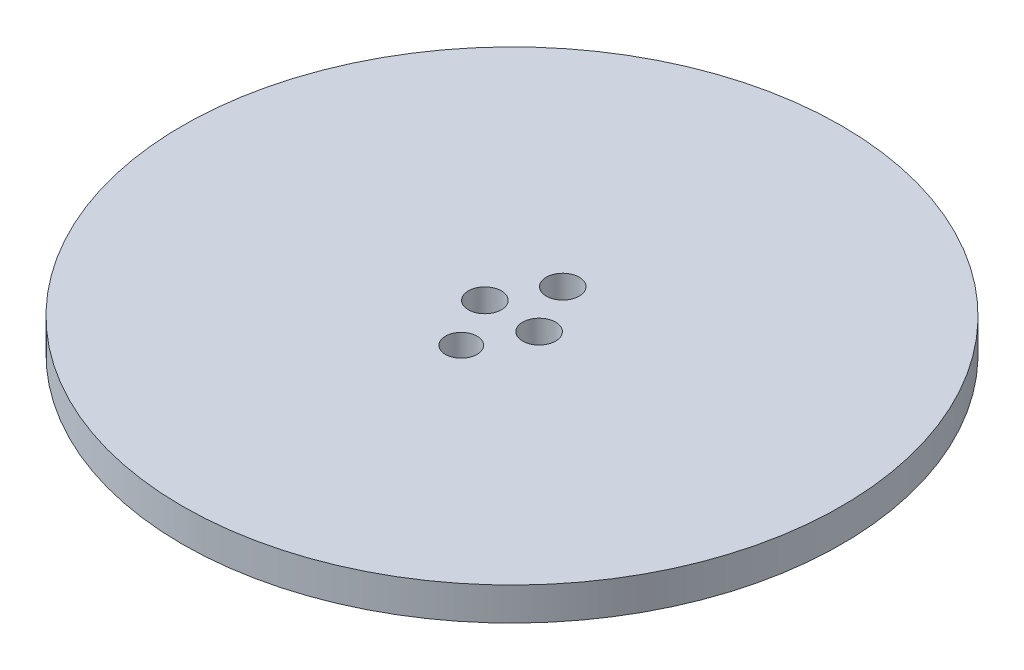
ISO-10303-21;
HEADER;
FILE_DESCRIPTION(('STEP AP214'),'2;1');
FILE_NAME('part.step','',(''),(''),'','','');
FILE_SCHEMA(('AUTOMOTIVE_DESIGN { 1 0 10303 214 1 1 1 1 }'));
ENDSEC;
DATA;
#1=APPLICATION_CONTEXT('core data for automotive mechanical design processes');
#2=APPLICATION_PROTOCOL_DEFINITION('international standard','automotive_design',2000,#1);
#3=PRODUCT_CONTEXT('',#1,'mechanical');
#4=PRODUCT('Part','Part','',(#3));
#5=PRODUCT_RELATED_PRODUCT_CATEGORY('part','',(#4));
#6=PRODUCT_DEFINITION_FORMATION('','',#4);
#7=PRODUCT_DEFINITION_CONTEXT('part definition',#1,'design');
#8=PRODUCT_DEFINITION('design','',#6,#7);
#9=PRODUCT_DEFINITION_SHAPE('','',#8);
#10=(LENGTH_UNIT() NAMED_UNIT(*) SI_UNIT(.MILLI.,.METRE.));
#11=(NAMED_UNIT(*) PLANE_ANGLE_UNIT() SI_UNIT($,.RADIAN.));
#12=(NAMED_UNIT(*) SI_UNIT($,.STERADIAN.) SOLID_ANGLE_UNIT());
#13=UNCERTAINTY_MEASURE_WITH_UNIT(LENGTH_MEASURE(1.E-05),#10,'distance_accuracy_value','');
#14=(GEOMETRIC_REPRESENTATION_CONTEXT(3) GLOBAL_UNCERTAINTY_ASSIGNED_CONTEXT((#13)) GLOBAL_UNIT_ASSIGNED_CONTEXT((#10,
#11,#12)) REPRESENTATION_CONTEXT('',''));
#15=CARTESIAN_POINT('',(0.,0.,0.));
#16=DIRECTION('',(0.,0.,1.));
#17=DIRECTION('',(1.,0.,0.));
#18=AXIS2_PLACEMENT_3D('',#15,#16,#17);
#19=CARTESIAN_POINT('',(0.,6.35,0.));
#20=DIRECTION('',(0.,-1.,0.));
#21=DIRECTION('',(0.,0.,-1.));
#22=AXIS2_PLACEMENT_3D('',#19,#20,#21);
#23=CYLINDRICAL_SURFACE('',#22,15.875);
#24=CARTESIAN_POINT('',(0.,6.35,0.));
#25=DIRECTION('',(0.,1.,0.));
#26=DIRECTION('',(0.,0.,1.));
#27=AXIS2_PLACEMENT_3D('',#24,#25,#26);
#28=CIRCLE('',#27,15.875);
#29=CARTESIAN_POINT('',(0.,6.35,15.875));
#30=VERTEX_POINT('',#29);
#31=EDGE_CURVE('E10',#30,#30,#28,.T.);
#32=ORIENTED_EDGE('',*,*,#31,.F.);
#33=EDGE_LOOP('',(#32));
#34=FACE_BOUND('',#33,.T.);
#35=CARTESIAN_POINT('',(0.,0.,0.));
#36=DIRECTION('',(0.,1.,0.));
#37=DIRECTION('',(0.,0.,1.));
#38=AXIS2_PLACEMENT_3D('',#35,#36,#37);
#39=CIRCLE('',#38,15.875);
#40=CARTESIAN_POINT('',(0.,0.,15.875));
#41=VERTEX_POINT('',#40);
#42=EDGE_CURVE('E34',#41,#41,#39,.T.);
#43=ORIENTED_EDGE('',*,*,#42,.T.);
#44=EDGE_LOOP('',(#43));
#45=FACE_BOUND('',#44,.T.);
#46=ADVANCED_FACE('F31',(#34,#45),#23,.T.);
#47=CARTESIAN_POINT('',(0.,0.,0.));
#48=DIRECTION('',(0.,1.,0.));
#49=DIRECTION('',(0.,0.,1.));
#50=AXIS2_PLACEMENT_3D('',#47,#48,#49);
#51=PLANE('',#50);
#52=CARTESIAN_POINT('',(5.22478,0.,0.));
#53=DIRECTION('',(0.,-1.,0.));
#54=DIRECTION('',(0.,0.,-1.));
#55=AXIS2_PLACEMENT_3D('',#52,#53,#54);
#56=CIRCLE('',#55,3.175);
#57=CARTESIAN_POINT('',(5.22478,0.,-3.175));
#58=VERTEX_POINT('',#57);
#59=EDGE_CURVE('E67',#58,#58,#56,.T.);
#60=ORIENTED_EDGE('',*,*,#59,.F.);
#61=EDGE_LOOP('',(#60));
#62=FACE_BOUND('',#61,.T.);
#63=CARTESIAN_POINT('',(-5.22478,0.,0.));
#64=DIRECTION('',(0.,-1.,0.));
#65=DIRECTION('',(0.,0.,-1.));
#66=AXIS2_PLACEMENT_3D('',#63,#64,#65);
#67=CIRCLE('',#66,3.175);
#68=CARTESIAN_POINT('',(-5.22478,0.,-3.175));
#69=VERTEX_POINT('',#68);
#70=EDGE_CURVE('E61',#69,#69,#67,.T.);
#71=ORIENTED_EDGE('',*,*,#70,.F.);
#72=EDGE_LOOP('',(#71));
#73=FACE_BOUND('',#72,.T.);
#74=CARTESIAN_POINT('',(0.,0.,-9.779));
#75=DIRECTION('',(0.,-1.,0.));
#76=DIRECTION('',(0.,0.,-1.));
#77=AXIS2_PLACEMENT_3D('',#74,#75,#76);
#78=CIRCLE('',#77,3.175);
#79=CARTESIAN_POINT('',(0.,0.,-12.954));
#80=VERTEX_POINT('',#79);
#81=EDGE_CURVE('E55',#80,#80,#78,.T.);
#82=ORIENTED_EDGE('',*,*,#81,.F.);
#83=EDGE_LOOP('',(#82));
#84=FACE_BOUND('',#83,.T.);
#85=CARTESIAN_POINT('',(0.,0.,9.779));
#86=DIRECTION('',(0.,-1.,0.));
#87=DIRECTION('',(0.,0.,-1.));
#88=AXIS2_PLACEMENT_3D('',#85,#86,#87);
#89=CIRCLE('',#88,3.048);
#90=CARTESIAN_POINT('',(0.,0.,6.731));
#91=VERTEX_POINT('',#90);
#92=EDGE_CURVE('E49',#91,#91,#89,.T.);
#93=ORIENTED_EDGE('',*,*,#92,.F.);
#94=EDGE_LOOP('',(#93));
#95=FACE_BOUND('',#94,.T.);
#96=ORIENTED_EDGE('',*,*,#42,.F.);
#97=EDGE_LOOP('',(#96));
#98=FACE_BOUND('',#97,.T.);
#99=ADVANCED_FACE('F83',(#62,#73,#84,#95,#98),#51,.F.);
#100=CARTESIAN_POINT('',(0.,12.7,0.));
#101=DIRECTION('',(0.,-1.,0.));
#102=DIRECTION('',(0.,0.,-1.));
#103=AXIS2_PLACEMENT_3D('',#100,#101,#102);
#104=CYLINDRICAL_SURFACE('',#103,63.5);
#105=CARTESIAN_POINT('',(0.,12.7,0.));
#106=DIRECTION('',(0.,1.,0.));
#107=DIRECTION('',(0.,0.,1.));
#108=AXIS2_PLACEMENT_3D('',#105,#106,#107);
#109=CIRCLE('',#108,63.5);
#110=CARTESIAN_POINT('',(0.,12.7,63.5));
#111=VERTEX_POINT('',#110);
#112=EDGE_CURVE('E41',#111,#111,#109,.T.);
#113=ORIENTED_EDGE('',*,*,#112,.F.);
#114=EDGE_LOOP('',(#113));
#115=FACE_BOUND('',#114,.T.);
#116=CARTESIAN_POINT('',(0.,6.35,0.));
#117=DIRECTION('',(0.,1.,0.));
#118=DIRECTION('',(0.,0.,1.));
#119=AXIS2_PLACEMENT_3D('',#116,#117,#118);
#120=CIRCLE('',#119,63.5);
#121=CARTESIAN_POINT('',(0.,6.35,63.5));
#122=VERTEX_POINT('',#121);
#123=EDGE_CURVE('E43',#122,#122,#120,.T.);
#124=ORIENTED_EDGE('',*,*,#123,.T.);
#125=EDGE_LOOP('',(#124));
#126=FACE_BOUND('',#125,.T.);
#127=ADVANCED_FACE('F86',(#115,#126),#104,.T.);
#128=CARTESIAN_POINT('',(0.,12.7,0.));
#129=DIRECTION('',(0.,1.,0.));
#130=DIRECTION('',(0.,0.,1.));
#131=AXIS2_PLACEMENT_3D('',#128,#129,#130);
#132=PLANE('',#131);
#133=CARTESIAN_POINT('',(5.22478,12.7,0.));
#134=DIRECTION('',(0.,-1.,0.));
#135=DIRECTION('',(0.,0.,-1.));
#136=AXIS2_PLACEMENT_3D('',#133,#134,#135);
#137=CIRCLE('',#136,3.175);
#138=CARTESIAN_POINT('',(5.22478,12.7,-3.175));
#139=VERTEX_POINT('',#138);
#140=EDGE_CURVE('E64',#139,#139,#137,.T.);
#141=ORIENTED_EDGE('',*,*,#140,.T.);
#142=EDGE_LOOP('',(#141));
#143=FACE_BOUND('',#142,.T.);
#144=CARTESIAN_POINT('',(-5.22478,12.7,0.));
#145=DIRECTION('',(0.,-1.,0.));
#146=DIRECTION('',(0.,0.,-1.));
#147=AXIS2_PLACEMENT_3D('',#144,#145,#146);
#148=CIRCLE('',#147,3.175);
#149=CARTESIAN_POINT('',(-5.22478,12.7,-3.175));
#150=VERTEX_POINT('',#149);
#151=EDGE_CURVE('E58',#150,#150,#148,.T.);
#152=ORIENTED_EDGE('',*,*,#151,.T.);
#153=EDGE_LOOP('',(#152));
#154=FACE_BOUND('',#153,.T.);
#155=CARTESIAN_POINT('',(0.,12.7,-9.779));
#156=DIRECTION('',(0.,-1.,0.));
#157=DIRECTION('',(0.,0.,-1.));
#158=AXIS2_PLACEMENT_3D('',#155,#156,#157);
#159=CIRCLE('',#158,3.175);
#160=CARTESIAN_POINT('',(0.,12.7,-12.954));
#161=VERTEX_POINT('',#160);
#162=EDGE_CURVE('E52',#161,#161,#159,.T.);
#163=ORIENTED_EDGE('',*,*,#162,.T.);
#164=EDGE_LOOP('',(#163));
#165=FACE_BOUND('',#164,.T.);
#166=CARTESIAN_POINT('',(0.,12.7,9.779));
#167=DIRECTION('',(0.,-1.,0.));
#168=DIRECTION('',(0.,0.,-1.));
#169=AXIS2_PLACEMENT_3D('',#166,#167,#168);
#170=CIRCLE('',#169,3.048);
#171=CARTESIAN_POINT('',(0.,12.7,6.731));
#172=VERTEX_POINT('',#171);
#173=EDGE_CURVE('E46',#172,#172,#170,.T.);
#174=ORIENTED_EDGE('',*,*,#173,.T.);
#175=EDGE_LOOP('',(#174));
#176=FACE_BOUND('',#175,.T.);
#177=ORIENTED_EDGE('',*,*,#112,.T.);
#178=EDGE_LOOP('',(#177));
#179=FACE_BOUND('',#178,.T.);
#180=ADVANCED_FACE('F73',(#143,#154,#165,#176,#179),#132,.T.);
#181=CARTESIAN_POINT('',(0.,6.35,0.));
#182=DIRECTION('',(0.,1.,0.));
#183=DIRECTION('',(0.,0.,1.));
#184=AXIS2_PLACEMENT_3D('',#181,#182,#183);
#185=PLANE('',#184);
#186=ORIENTED_EDGE('',*,*,#31,.T.);
#187=EDGE_LOOP('',(#186));
#188=FACE_BOUND('',#187,.T.);
#189=ORIENTED_EDGE('',*,*,#123,.F.);
#190=EDGE_LOOP('',(#189));
#191=FACE_BOUND('',#190,.T.);
#192=ADVANCED_FACE('F118',(#188,#191),#185,.F.);
#193=CARTESIAN_POINT('',(0.,12.7,9.779));
#194=DIRECTION('',(0.,-1.,0.));
#195=DIRECTION('',(0.,0.,-1.));
#196=AXIS2_PLACEMENT_3D('',#193,#194,#195);
#197=CYLINDRICAL_SURFACE('',#196,3.048);
#198=ORIENTED_EDGE('',*,*,#173,.F.);
#199=EDGE_LOOP('',(#198));
#200=FACE_BOUND('',#199,.T.);
#201=ORIENTED_EDGE('',*,*,#92,.T.);
#202=EDGE_LOOP('',(#201));
#203=FACE_BOUND('',#202,.T.);
#204=ADVANCED_FACE('F125',(#200,#203),#197,.F.);
#205=CARTESIAN_POINT('',(0.,12.7,-9.779));
#206=DIRECTION('',(0.,-1.,0.));
#207=DIRECTION('',(0.,0.,-1.));
#208=AXIS2_PLACEMENT_3D('',#205,#206,#207);
#209=CYLINDRICAL_SURFACE('',#208,3.175);
#210=ORIENTED_EDGE('',*,*,#162,.F.);
#211=EDGE_LOOP('',(#210));
#212=FACE_BOUND('',#211,.T.);
#213=ORIENTED_EDGE('',*,*,#81,.T.);
#214=EDGE_LOOP('',(#213));
#215=FACE_BOUND('',#214,.T.);
#216=ADVANCED_FACE('F132',(#212,#215),#209,.F.);
#217=CARTESIAN_POINT('',(-5.22478,12.7,0.));
#218=DIRECTION('',(0.,-1.,0.));
#219=DIRECTION('',(0.,0.,-1.));
#220=AXIS2_PLACEMENT_3D('',#217,#218,#219);
#221=CYLINDRICAL_SURFACE('',#220,3.175);
#222=ORIENTED_EDGE('',*,*,#151,.F.);
#223=EDGE_LOOP('',(#222));
#224=FACE_BOUND('',#223,.T.);
#225=ORIENTED_EDGE('',*,*,#70,.T.);
#226=EDGE_LOOP('',(#225));
#227=FACE_BOUND('',#226,.T.);
#228=ADVANCED_FACE('F79',(#224,#227),#221,.F.);
#229=CARTESIAN_POINT('',(5.22478,12.7,0.));
#230=DIRECTION('',(0.,-1.,0.));
#231=DIRECTION('',(0.,0.,-1.));
#232=AXIS2_PLACEMENT_3D('',#229,#230,#231);
#233=CYLINDRICAL_SURFACE('',#232,3.175);
#234=ORIENTED_EDGE('',*,*,#140,.F.);
#235=EDGE_LOOP('',(#234));
#236=FACE_BOUND('',#235,.T.);
#237=ORIENTED_EDGE('',*,*,#59,.T.);
#238=EDGE_LOOP('',(#237));
#239=FACE_BOUND('',#238,.T.);
#240=ADVANCED_FACE('F76',(#236,#239),#233,.F.);
#241=CLOSED_SHELL('',(#46,#99,#127,#180,#192,#204,#216,#228,#240));
#242=MANIFOLD_SOLID_BREP('B2',#241);
#243=ADVANCED_BREP_SHAPE_REPRESENTATION('',(#18,#242),#14);
#244=SHAPE_DEFINITION_REPRESENTATION(#9,#243);
ENDSEC;
END-ISO-10303-21;
